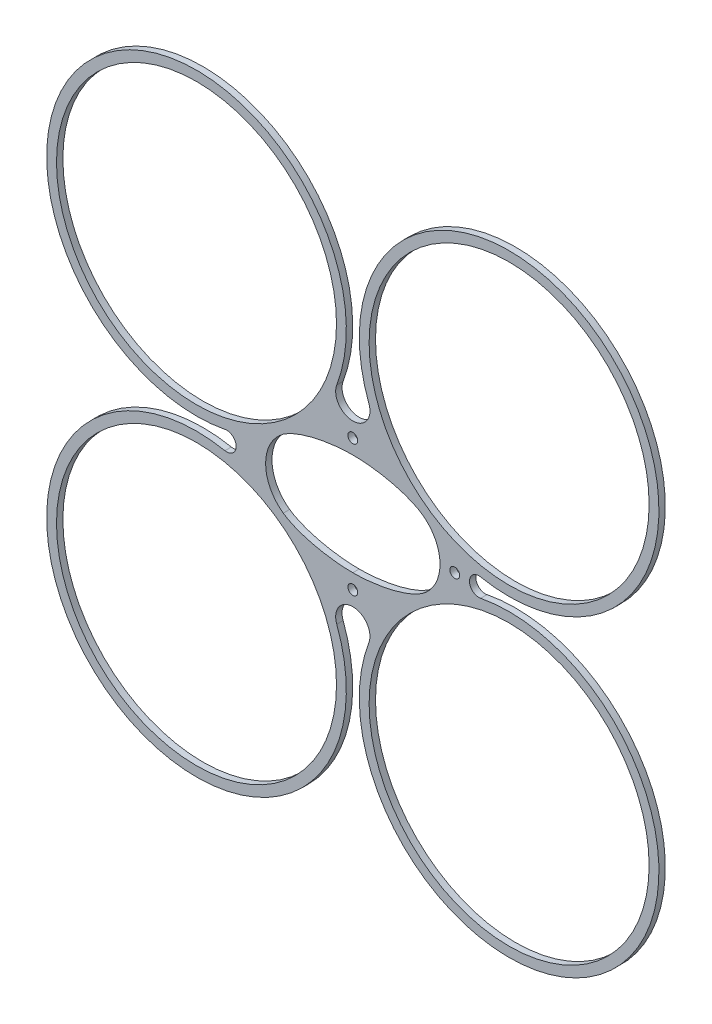
ISO-10303-21;
HEADER;
FILE_DESCRIPTION(('STEP AP214'),'2;1');
FILE_NAME('part.step','',(''),(''),'','','');
FILE_SCHEMA(('AUTOMOTIVE_DESIGN { 1 0 10303 214 1 1 1 1 }'));
ENDSEC;
DATA;
#1=APPLICATION_CONTEXT('core data for automotive mechanical design processes');
#2=APPLICATION_PROTOCOL_DEFINITION('international standard','automotive_design',2000,#1);
#3=PRODUCT_CONTEXT('',#1,'mechanical');
#4=PRODUCT('Part','Part','',(#3));
#5=PRODUCT_RELATED_PRODUCT_CATEGORY('part','',(#4));
#6=PRODUCT_DEFINITION_FORMATION('','',#4);
#7=PRODUCT_DEFINITION_CONTEXT('part definition',#1,'design');
#8=PRODUCT_DEFINITION('design','',#6,#7);
#9=PRODUCT_DEFINITION_SHAPE('','',#8);
#10=(LENGTH_UNIT() NAMED_UNIT(*) SI_UNIT(.MILLI.,.METRE.));
#11=(NAMED_UNIT(*) PLANE_ANGLE_UNIT() SI_UNIT($,.RADIAN.));
#12=(NAMED_UNIT(*) SI_UNIT($,.STERADIAN.) SOLID_ANGLE_UNIT());
#13=UNCERTAINTY_MEASURE_WITH_UNIT(LENGTH_MEASURE(1.E-05),#10,'distance_accuracy_value','');
#14=(GEOMETRIC_REPRESENTATION_CONTEXT(3) GLOBAL_UNCERTAINTY_ASSIGNED_CONTEXT((#13)) GLOBAL_UNIT_ASSIGNED_CONTEXT((#10,
#11,#12)) REPRESENTATION_CONTEXT('',''));
#15=CARTESIAN_POINT('',(0.,0.,0.));
#16=DIRECTION('',(0.,0.,1.));
#17=DIRECTION('',(1.,0.,0.));
#18=AXIS2_PLACEMENT_3D('',#15,#16,#17);
#19=CARTESIAN_POINT('',(-31.8198051533946,31.8198051533946,1.3));
#20=DIRECTION('',(0.,0.,-1.));
#21=DIRECTION('',(-1.,0.,0.));
#22=AXIS2_PLACEMENT_3D('',#19,#20,#21);
#23=CYLINDRICAL_SURFACE('',#22,30.5);
#24=DIRECTION('',(0.,0.,-1.));
#25=VECTOR('',#24,1.);
#26=CARTESIAN_POINT('',(-26.0235218489606,1.87563877904487,32.954508908163));
#27=LINE('',#26,#25);
#28=CARTESIAN_POINT('',(-26.0235218489606,1.87563877904487,1.3));
#29=VERTEX_POINT('',#28);
#30=CARTESIAN_POINT('',(-26.0235218489606,1.87563877904487,0.));
#31=VERTEX_POINT('',#30);
#32=EDGE_CURVE('E217',#29,#31,#27,.T.);
#33=ORIENTED_EDGE('',*,*,#32,.F.);
#34=CARTESIAN_POINT('',(-31.8198051533946,31.8198051533946,1.3));
#35=DIRECTION('',(0.,0.,1.));
#36=DIRECTION('',(1.,0.,0.));
#37=AXIS2_PLACEMENT_3D('',#34,#35,#36);
#38=CIRCLE('',#37,30.5);
#39=CARTESIAN_POINT('',(-3.26805949840784,21.0937704689018,1.3));
#40=VERTEX_POINT('',#39);
#41=EDGE_CURVE('E12',#40,#29,#38,.T.);
#42=ORIENTED_EDGE('',*,*,#41,.F.);
#43=DIRECTION('',(0.,0.,-1.));
#44=VECTOR('',#43,1.);
#45=CARTESIAN_POINT('',(-3.26805949840784,21.0937704689018,32.954508908163));
#46=LINE('',#45,#44);
#47=CARTESIAN_POINT('',(-3.26805949840784,21.0937704689018,0.));
#48=VERTEX_POINT('',#47);
#49=EDGE_CURVE('E219',#40,#48,#46,.T.);
#50=ORIENTED_EDGE('',*,*,#49,.T.);
#51=CARTESIAN_POINT('',(-31.8198051533946,31.8198051533946,0.));
#52=DIRECTION('',(0.,0.,1.));
#53=DIRECTION('',(1.,0.,0.));
#54=AXIS2_PLACEMENT_3D('',#51,#52,#53);
#55=CIRCLE('',#54,30.5);
#56=EDGE_CURVE('E49',#48,#31,#55,.T.);
#57=ORIENTED_EDGE('',*,*,#56,.T.);
#58=EDGE_LOOP('',(#33,#42,#50,#57));
#59=FACE_BOUND('',#58,.T.);
#60=ADVANCED_FACE('F45',(#59),#23,.T.);
#61=CARTESIAN_POINT('',(-31.8198051533946,-31.8198051533946,1.3));
#62=DIRECTION('',(0.,0.,-1.));
#63=DIRECTION('',(-1.,0.,0.));
#64=AXIS2_PLACEMENT_3D('',#61,#62,#63);
#65=CYLINDRICAL_SURFACE('',#64,30.5);
#66=CARTESIAN_POINT('',(-31.8198051533946,-31.8198051533946,1.3));
#67=DIRECTION('',(0.,0.,1.));
#68=DIRECTION('',(1.,0.,0.));
#69=AXIS2_PLACEMENT_3D('',#66,#67,#68);
#70=CIRCLE('',#69,30.5);
#71=CARTESIAN_POINT('',(-3.26805949840784,-21.0937704689018,1.3));
#72=VERTEX_POINT('',#71);
#73=CARTESIAN_POINT('',(-26.0235218489606,-1.87563877904487,1.3));
#74=VERTEX_POINT('',#73);
#75=EDGE_CURVE('E67',#72,#74,#70,.F.);
#76=ORIENTED_EDGE('',*,*,#75,.T.);
#77=DIRECTION('',(0.,0.,-1.));
#78=VECTOR('',#77,1.);
#79=CARTESIAN_POINT('',(-26.0235218489606,-1.87563877904487,32.954508908163));
#80=LINE('',#79,#78);
#81=CARTESIAN_POINT('',(-26.0235218489606,-1.87563877904487,0.));
#82=VERTEX_POINT('',#81);
#83=EDGE_CURVE('E62',#74,#82,#80,.T.);
#84=ORIENTED_EDGE('',*,*,#83,.T.);
#85=CARTESIAN_POINT('',(-31.8198051533946,-31.8198051533946,0.));
#86=DIRECTION('',(0.,0.,1.));
#87=DIRECTION('',(1.,0.,0.));
#88=AXIS2_PLACEMENT_3D('',#85,#86,#87);
#89=CIRCLE('',#88,30.5);
#90=CARTESIAN_POINT('',(-3.26805949840783,-21.0937704689018,0.));
#91=VERTEX_POINT('',#90);
#92=EDGE_CURVE('E168',#91,#82,#89,.F.);
#93=ORIENTED_EDGE('',*,*,#92,.F.);
#94=DIRECTION('',(0.,0.,-1.));
#95=VECTOR('',#94,1.);
#96=CARTESIAN_POINT('',(-3.26805949840783,-21.0937704689018,32.954508908163));
#97=LINE('',#96,#95);
#98=EDGE_CURVE('E262',#72,#91,#97,.T.);
#99=ORIENTED_EDGE('',*,*,#98,.F.);
#100=EDGE_LOOP('',(#76,#84,#93,#99));
#101=FACE_BOUND('',#100,.T.);
#102=ADVANCED_FACE('F352',(#101),#65,.T.);
#103=CARTESIAN_POINT('',(31.8198051533946,31.8198051533946,1.3));
#104=DIRECTION('',(0.,0.,-1.));
#105=DIRECTION('',(-1.,0.,0.));
#106=AXIS2_PLACEMENT_3D('',#103,#104,#105);
#107=CYLINDRICAL_SURFACE('',#106,30.5);
#108=CARTESIAN_POINT('',(31.8198051533946,31.8198051533946,1.3));
#109=DIRECTION('',(0.,0.,1.));
#110=DIRECTION('',(1.,0.,0.));
#111=AXIS2_PLACEMENT_3D('',#108,#109,#110);
#112=CIRCLE('',#111,30.5);
#113=CARTESIAN_POINT('',(3.26805949840783,21.0937704689018,1.3));
#114=VERTEX_POINT('',#113);
#115=CARTESIAN_POINT('',(26.0235218489606,1.87563877904487,1.3));
#116=VERTEX_POINT('',#115);
#117=EDGE_CURVE('E400',#114,#116,#112,.F.);
#118=ORIENTED_EDGE('',*,*,#117,.T.);
#119=DIRECTION('',(0.,0.,-1.));
#120=VECTOR('',#119,1.);
#121=CARTESIAN_POINT('',(26.0235218489606,1.87563877904486,32.954508908163));
#122=LINE('',#121,#120);
#123=CARTESIAN_POINT('',(26.0235218489606,1.87563877904487,0.));
#124=VERTEX_POINT('',#123);
#125=EDGE_CURVE('E408',#116,#124,#122,.T.);
#126=ORIENTED_EDGE('',*,*,#125,.T.);
#127=CARTESIAN_POINT('',(31.8198051533946,31.8198051533946,0.));
#128=DIRECTION('',(0.,0.,1.));
#129=DIRECTION('',(1.,0.,0.));
#130=AXIS2_PLACEMENT_3D('',#127,#128,#129);
#131=CIRCLE('',#130,30.5);
#132=CARTESIAN_POINT('',(3.26805949840783,21.0937704689018,0.));
#133=VERTEX_POINT('',#132);
#134=EDGE_CURVE('E401',#133,#124,#131,.F.);
#135=ORIENTED_EDGE('',*,*,#134,.F.);
#136=DIRECTION('',(0.,0.,-1.));
#137=VECTOR('',#136,1.);
#138=CARTESIAN_POINT('',(3.26805949840783,21.0937704689018,32.954508908163));
#139=LINE('',#138,#137);
#140=EDGE_CURVE('E372',#114,#133,#139,.T.);
#141=ORIENTED_EDGE('',*,*,#140,.F.);
#142=EDGE_LOOP('',(#118,#126,#135,#141));
#143=FACE_BOUND('',#142,.T.);
#144=ADVANCED_FACE('F349',(#143),#107,.T.);
#145=CARTESIAN_POINT('',(-31.8198051533946,31.8198051533946,1.3));
#146=DIRECTION('',(0.,0.,-1.));
#147=DIRECTION('',(-1.,0.,0.));
#148=AXIS2_PLACEMENT_3D('',#145,#146,#147);
#149=CYLINDRICAL_SURFACE('',#148,28.5);
#150=CARTESIAN_POINT('',(-31.8198051533946,31.8198051533946,1.3));
#151=DIRECTION('',(0.,0.,1.));
#152=DIRECTION('',(1.,0.,0.));
#153=AXIS2_PLACEMENT_3D('',#150,#151,#152);
#154=CIRCLE('',#153,28.5);
#155=CARTESIAN_POINT('',(-3.31980515339463,31.8198051533946,1.3));
#156=VERTEX_POINT('',#155);
#157=EDGE_CURVE('E54',#156,#156,#154,.T.);
#158=ORIENTED_EDGE('',*,*,#157,.T.);
#159=EDGE_LOOP('',(#158));
#160=FACE_BOUND('',#159,.T.);
#161=CARTESIAN_POINT('',(-31.8198051533946,31.8198051533946,0.));
#162=DIRECTION('',(0.,0.,1.));
#163=DIRECTION('',(1.,0.,0.));
#164=AXIS2_PLACEMENT_3D('',#161,#162,#163);
#165=CIRCLE('',#164,28.5);
#166=CARTESIAN_POINT('',(-3.31980515339463,31.8198051533946,0.));
#167=VERTEX_POINT('',#166);
#168=EDGE_CURVE('E180',#167,#167,#165,.T.);
#169=ORIENTED_EDGE('',*,*,#168,.F.);
#170=EDGE_LOOP('',(#169));
#171=FACE_BOUND('',#170,.T.);
#172=ADVANCED_FACE('F47',(#160,#171),#149,.F.);
#173=CARTESIAN_POINT('',(0.,0.,1.3));
#174=DIRECTION('',(0.,0.,1.));
#175=DIRECTION('',(1.,0.,0.));
#176=AXIS2_PLACEMENT_3D('',#173,#174,#175);
#177=PLANE('',#176);
#178=ORIENTED_EDGE('',*,*,#41,.T.);
#179=CARTESIAN_POINT('',(-25.6604550130296,0.,1.3));
#180=DIRECTION('',(0.,0.,1.));
#181=DIRECTION('',(1.,0.,0.));
#182=AXIS2_PLACEMENT_3D('',#179,#180,#181);
#183=CIRCLE('',#182,1.91045501302958);
#184=EDGE_CURVE('E169',#29,#74,#183,.F.);
#185=ORIENTED_EDGE('',*,*,#184,.T.);
#186=ORIENTED_EDGE('',*,*,#75,.F.);
#187=CARTESIAN_POINT('',(0.,-19.8660585120048,1.3));
#188=DIRECTION('',(0.,0.,1.));
#189=DIRECTION('',(1.,0.,0.));
#190=AXIS2_PLACEMENT_3D('',#187,#188,#189);
#191=CIRCLE('',#190,3.49105851200484);
#192=CARTESIAN_POINT('',(3.26805949840784,-21.0937704689018,1.3));
#193=VERTEX_POINT('',#192);
#194=EDGE_CURVE('E274',#72,#193,#191,.F.);
#195=ORIENTED_EDGE('',*,*,#194,.T.);
#196=CARTESIAN_POINT('',(31.8198051533946,-31.8198051533946,1.3));
#197=DIRECTION('',(0.,0.,1.));
#198=DIRECTION('',(1.,0.,0.));
#199=AXIS2_PLACEMENT_3D('',#196,#197,#198);
#200=CIRCLE('',#199,30.5);
#201=CARTESIAN_POINT('',(26.0235218489606,-1.87563877904487,1.3));
#202=VERTEX_POINT('',#201);
#203=EDGE_CURVE('E411',#193,#202,#200,.T.);
#204=ORIENTED_EDGE('',*,*,#203,.T.);
#205=CARTESIAN_POINT('',(25.6604550130296,0.,1.3));
#206=DIRECTION('',(0.,0.,1.));
#207=DIRECTION('',(1.,0.,0.));
#208=AXIS2_PLACEMENT_3D('',#205,#206,#207);
#209=CIRCLE('',#208,1.91045501302958);
#210=EDGE_CURVE('E403',#202,#116,#209,.F.);
#211=ORIENTED_EDGE('',*,*,#210,.T.);
#212=ORIENTED_EDGE('',*,*,#117,.F.);
#213=CARTESIAN_POINT('',(0.,19.8660585120048,1.3));
#214=DIRECTION('',(0.,0.,1.));
#215=DIRECTION('',(1.,0.,0.));
#216=AXIS2_PLACEMENT_3D('',#213,#214,#215);
#217=CIRCLE('',#216,3.49105851200484);
#218=EDGE_CURVE('E175',#114,#40,#217,.F.);
#219=ORIENTED_EDGE('',*,*,#218,.T.);
#220=EDGE_LOOP('',(#178,#185,#186,#195,#204,#211,#212,#219));
#221=FACE_BOUND('',#220,.T.);
#222=ORIENTED_EDGE('',*,*,#157,.F.);
#223=EDGE_LOOP('',(#222));
#224=FACE_BOUND('',#223,.T.);
#225=CARTESIAN_POINT('',(-9.22272994414966,0.,1.3));
#226=DIRECTION('',(0.,0.,1.));
#227=DIRECTION('',(1.,0.,0.));
#228=AXIS2_PLACEMENT_3D('',#225,#226,#227);
#229=CIRCLE('',#228,8.52727005585035);
#230=CARTESIAN_POINT('',(-14.1600817626561,-6.95247377741863,1.3));
#231=VERTEX_POINT('',#230);
#232=CARTESIAN_POINT('',(-14.1600817626561,6.95247377741863,1.3));
#233=VERTEX_POINT('',#232);
#234=EDGE_CURVE('E150',#231,#233,#229,.F.);
#235=ORIENTED_EDGE('',*,*,#234,.T.);
#236=CARTESIAN_POINT('',(-14.1600817626561,6.95247377741862,1.3));
#237=CARTESIAN_POINT('',(-14.0064429353834,7.06158155222128,1.3));
#238=CARTESIAN_POINT('',(-11.2813054528987,8.85129628165308,1.3));
#239=CARTESIAN_POINT('',(-5.53301689050233,10.3110837571394,1.3));
#240=CARTESIAN_POINT('',(-0.273902084835145,10.375,1.3));
#241=CARTESIAN_POINT('',(0.,10.375,1.3));
#242=B_SPLINE_CURVE_WITH_KNOTS('',3,(#236,#237,#238,#239,#240,#241),.UNSPECIFIED.,.F.,.F.,(4,1,
1,4),(0.,0.05,0.95,1.),.UNSPECIFIED.);
#243=CARTESIAN_POINT('',(0.,10.375,1.3));
#244=VERTEX_POINT('',#243);
#245=EDGE_CURVE('E164',#233,#244,#242,.T.);
#246=ORIENTED_EDGE('',*,*,#245,.T.);
#247=CARTESIAN_POINT('',(14.1600817626561,6.95247377741862,1.3));
#248=CARTESIAN_POINT('',(14.0064429353834,7.06158155222129,1.3));
#249=CARTESIAN_POINT('',(11.2813054528987,8.85129628165309,1.3));
#250=CARTESIAN_POINT('',(5.53301689050233,10.3110837571394,1.3));
#251=CARTESIAN_POINT('',(0.273902084835145,10.375,1.3));
#252=CARTESIAN_POINT('',(0.,10.375,1.3));
#253=B_SPLINE_CURVE_WITH_KNOTS('',3,(#247,#248,#249,#250,#251,#252),.UNSPECIFIED.,.F.,.F.,(4,1,
1,4),(0.,0.05,0.95,1.),.UNSPECIFIED.);
#254=CARTESIAN_POINT('',(14.1600817626561,6.95247377741862,1.3));
#255=VERTEX_POINT('',#254);
#256=EDGE_CURVE('E191',#255,#244,#253,.T.);
#257=ORIENTED_EDGE('',*,*,#256,.F.);
#258=CARTESIAN_POINT('',(9.22272994414966,0.,1.3));
#259=DIRECTION('',(0.,0.,1.));
#260=DIRECTION('',(1.,0.,0.));
#261=AXIS2_PLACEMENT_3D('',#258,#259,#260);
#262=CIRCLE('',#261,8.52727005585035);
#263=CARTESIAN_POINT('',(14.1600817626561,-6.95247377741863,1.3));
#264=VERTEX_POINT('',#263);
#265=EDGE_CURVE('E410',#264,#255,#262,.T.);
#266=ORIENTED_EDGE('',*,*,#265,.F.);
#267=CARTESIAN_POINT('',(14.1600817626561,-6.95247377741861,1.3));
#268=CARTESIAN_POINT('',(14.0064429353834,-7.06158155222127,1.3));
#269=CARTESIAN_POINT('',(11.2813054528986,-8.85129628165309,1.3));
#270=CARTESIAN_POINT('',(5.53301689050233,-10.3110837571394,1.3));
#271=CARTESIAN_POINT('',(0.273902084835145,-10.375,1.3));
#272=CARTESIAN_POINT('',(0.,-10.375,1.3));
#273=B_SPLINE_CURVE_WITH_KNOTS('',3,(#267,#268,#269,#270,#271,#272),.UNSPECIFIED.,.F.,.F.,(4,1,
1,4),(0.,0.05,0.95,1.),.UNSPECIFIED.);
#274=CARTESIAN_POINT('',(0.,-10.375,1.3));
#275=VERTEX_POINT('',#274);
#276=EDGE_CURVE('E273',#264,#275,#273,.T.);
#277=ORIENTED_EDGE('',*,*,#276,.T.);
#278=CARTESIAN_POINT('',(-14.1600817626561,-6.95247377741862,1.3));
#279=CARTESIAN_POINT('',(-14.0064429353834,-7.06158155222128,1.3));
#280=CARTESIAN_POINT('',(-11.2813054528987,-8.85129628165308,1.3));
#281=CARTESIAN_POINT('',(-5.53301689050233,-10.3110837571394,1.3));
#282=CARTESIAN_POINT('',(-0.273902084835145,-10.375,1.3));
#283=CARTESIAN_POINT('',(0.,-10.375,1.3));
#284=B_SPLINE_CURVE_WITH_KNOTS('',3,(#278,#279,#280,#281,#282,#283),.UNSPECIFIED.,.F.,.F.,(4,1,
1,4),(0.,0.05,0.95,1.),.UNSPECIFIED.);
#285=EDGE_CURVE('E166',#231,#275,#284,.T.);
#286=ORIENTED_EDGE('',*,*,#285,.F.);
#287=EDGE_LOOP('',(#235,#246,#257,#266,#277,#286));
#288=FACE_BOUND('',#287,.T.);
#289=CARTESIAN_POINT('',(0.,13.375,1.3));
#290=DIRECTION('',(0.,0.,1.));
#291=DIRECTION('',(1.,0.,0.));
#292=AXIS2_PLACEMENT_3D('',#289,#290,#291);
#293=CIRCLE('',#292,1.);
#294=CARTESIAN_POINT('',(1.,13.375,1.3));
#295=VERTEX_POINT('',#294);
#296=EDGE_CURVE('E176',#295,#295,#293,.F.);
#297=ORIENTED_EDGE('',*,*,#296,.T.);
#298=EDGE_LOOP('',(#297));
#299=FACE_BOUND('',#298,.T.);
#300=CARTESIAN_POINT('',(31.8198051533946,31.8198051533946,1.3));
#301=DIRECTION('',(0.,0.,1.));
#302=DIRECTION('',(1.,0.,0.));
#303=AXIS2_PLACEMENT_3D('',#300,#301,#302);
#304=CIRCLE('',#303,28.5);
#305=CARTESIAN_POINT('',(60.3198051533946,31.8198051533946,1.3));
#306=VERTEX_POINT('',#305);
#307=EDGE_CURVE('E158',#306,#306,#304,.F.);
#308=ORIENTED_EDGE('',*,*,#307,.T.);
#309=EDGE_LOOP('',(#308));
#310=FACE_BOUND('',#309,.T.);
#311=CARTESIAN_POINT('',(20.75,0.,1.3));
#312=DIRECTION('',(0.,0.,1.));
#313=DIRECTION('',(1.,0.,0.));
#314=AXIS2_PLACEMENT_3D('',#311,#312,#313);
#315=CIRCLE('',#314,1.);
#316=CARTESIAN_POINT('',(21.75,0.,1.3));
#317=VERTEX_POINT('',#316);
#318=EDGE_CURVE('E420',#317,#317,#315,.F.);
#319=ORIENTED_EDGE('',*,*,#318,.T.);
#320=EDGE_LOOP('',(#319));
#321=FACE_BOUND('',#320,.T.);
#322=CARTESIAN_POINT('',(31.8198051533946,-31.8198051533946,1.3));
#323=DIRECTION('',(0.,0.,1.));
#324=DIRECTION('',(1.,0.,0.));
#325=AXIS2_PLACEMENT_3D('',#322,#323,#324);
#326=CIRCLE('',#325,28.5);
#327=CARTESIAN_POINT('',(60.3198051533946,-31.8198051533946,1.3));
#328=VERTEX_POINT('',#327);
#329=EDGE_CURVE('E434',#328,#328,#326,.T.);
#330=ORIENTED_EDGE('',*,*,#329,.F.);
#331=EDGE_LOOP('',(#330));
#332=FACE_BOUND('',#331,.T.);
#333=CARTESIAN_POINT('',(0.,-13.375,1.3));
#334=DIRECTION('',(0.,0.,1.));
#335=DIRECTION('',(1.,0.,0.));
#336=AXIS2_PLACEMENT_3D('',#333,#334,#335);
#337=CIRCLE('',#336,1.);
#338=CARTESIAN_POINT('',(1.,-13.375,1.3));
#339=VERTEX_POINT('',#338);
#340=EDGE_CURVE('E256',#339,#339,#337,.F.);
#341=ORIENTED_EDGE('',*,*,#340,.T.);
#342=EDGE_LOOP('',(#341));
#343=FACE_BOUND('',#342,.T.);
#344=CARTESIAN_POINT('',(-31.8198051533946,-31.8198051533946,1.3));
#345=DIRECTION('',(0.,0.,1.));
#346=DIRECTION('',(1.,0.,0.));
#347=AXIS2_PLACEMENT_3D('',#344,#345,#346);
#348=CIRCLE('',#347,28.5);
#349=CARTESIAN_POINT('',(-3.31980515339463,-31.8198051533946,1.3));
#350=VERTEX_POINT('',#349);
#351=EDGE_CURVE('E239',#350,#350,#348,.F.);
#352=ORIENTED_EDGE('',*,*,#351,.T.);
#353=EDGE_LOOP('',(#352));
#354=FACE_BOUND('',#353,.T.);
#355=ADVANCED_FACE('F162',(#221,#224,#288,#299,#310,#321,#332,#343,#354),#177,.T.);
#356=CARTESIAN_POINT('',(0.,0.,0.));
#357=DIRECTION('',(0.,0.,1.));
#358=DIRECTION('',(1.,0.,0.));
#359=AXIS2_PLACEMENT_3D('',#356,#357,#358);
#360=PLANE('',#359);
#361=CARTESIAN_POINT('',(-25.6604550130296,0.,0.));
#362=DIRECTION('',(0.,0.,-1.));
#363=DIRECTION('',(-1.,0.,0.));
#364=AXIS2_PLACEMENT_3D('',#361,#362,#363);
#365=CIRCLE('',#364,1.91045501302958);
#366=EDGE_CURVE('E228',#31,#82,#365,.T.);
#367=ORIENTED_EDGE('',*,*,#366,.F.);
#368=ORIENTED_EDGE('',*,*,#56,.F.);
#369=CARTESIAN_POINT('',(0.,19.8660585120048,0.));
#370=DIRECTION('',(0.,0.,-1.));
#371=DIRECTION('',(-1.,0.,0.));
#372=AXIS2_PLACEMENT_3D('',#369,#370,#371);
#373=CIRCLE('',#372,3.49105851200484);
#374=EDGE_CURVE('E226',#133,#48,#373,.T.);
#375=ORIENTED_EDGE('',*,*,#374,.F.);
#376=ORIENTED_EDGE('',*,*,#134,.T.);
#377=CARTESIAN_POINT('',(25.6604550130296,0.,0.));
#378=DIRECTION('',(0.,0.,-1.));
#379=DIRECTION('',(-1.,0.,0.));
#380=AXIS2_PLACEMENT_3D('',#377,#378,#379);
#381=CIRCLE('',#380,1.91045501302958);
#382=CARTESIAN_POINT('',(26.0235218489606,-1.87563877904486,0.));
#383=VERTEX_POINT('',#382);
#384=EDGE_CURVE('E415',#383,#124,#381,.T.);
#385=ORIENTED_EDGE('',*,*,#384,.F.);
#386=CARTESIAN_POINT('',(31.8198051533946,-31.8198051533946,0.));
#387=DIRECTION('',(0.,0.,1.));
#388=DIRECTION('',(1.,0.,0.));
#389=AXIS2_PLACEMENT_3D('',#386,#387,#388);
#390=CIRCLE('',#389,30.5);
#391=CARTESIAN_POINT('',(3.26805949840783,-21.0937704689018,0.));
#392=VERTEX_POINT('',#391);
#393=EDGE_CURVE('E432',#392,#383,#390,.T.);
#394=ORIENTED_EDGE('',*,*,#393,.F.);
#395=CARTESIAN_POINT('',(0.,-19.8660585120048,0.));
#396=DIRECTION('',(0.,0.,-1.));
#397=DIRECTION('',(-1.,0.,0.));
#398=AXIS2_PLACEMENT_3D('',#395,#396,#397);
#399=CIRCLE('',#398,3.49105851200484);
#400=EDGE_CURVE('E257',#91,#392,#399,.T.);
#401=ORIENTED_EDGE('',*,*,#400,.F.);
#402=ORIENTED_EDGE('',*,*,#92,.T.);
#403=EDGE_LOOP('',(#367,#368,#375,#376,#385,#394,#401,#402));
#404=FACE_BOUND('',#403,.T.);
#405=ORIENTED_EDGE('',*,*,#168,.T.);
#406=EDGE_LOOP('',(#405));
#407=FACE_BOUND('',#406,.T.);
#408=CARTESIAN_POINT('',(-14.1600817626561,6.95247377741862,0.));
#409=CARTESIAN_POINT('',(-14.0064429353834,7.06158155222128,0.));
#410=CARTESIAN_POINT('',(-11.2813054528987,8.85129628165308,0.));
#411=CARTESIAN_POINT('',(-5.53301689050233,10.3110837571394,0.));
#412=CARTESIAN_POINT('',(-0.273902084835145,10.375,0.));
#413=CARTESIAN_POINT('',(0.,10.375,0.));
#414=B_SPLINE_CURVE_WITH_KNOTS('',3,(#408,#409,#410,#411,#412,#413),.UNSPECIFIED.,.F.,.F.,(4,1,
1,4),(0.,0.05,0.95,1.),.UNSPECIFIED.);
#415=CARTESIAN_POINT('',(-14.1600817626561,6.95247377741863,0.));
#416=VERTEX_POINT('',#415);
#417=CARTESIAN_POINT('',(0.,10.375,0.));
#418=VERTEX_POINT('',#417);
#419=EDGE_CURVE('E157',#416,#418,#414,.T.);
#420=ORIENTED_EDGE('',*,*,#419,.F.);
#421=CARTESIAN_POINT('',(-9.22272994414966,0.,0.));
#422=DIRECTION('',(0.,0.,-1.));
#423=DIRECTION('',(-1.,0.,0.));
#424=AXIS2_PLACEMENT_3D('',#421,#422,#423);
#425=CIRCLE('',#424,8.52727005585035);
#426=CARTESIAN_POINT('',(-14.1600817626561,-6.95247377741863,0.));
#427=VERTEX_POINT('',#426);
#428=EDGE_CURVE('E152',#427,#416,#425,.T.);
#429=ORIENTED_EDGE('',*,*,#428,.F.);
#430=CARTESIAN_POINT('',(-14.1600817626561,-6.95247377741862,0.));
#431=CARTESIAN_POINT('',(-14.0064429353834,-7.06158155222128,0.));
#432=CARTESIAN_POINT('',(-11.2813054528987,-8.85129628165308,0.));
#433=CARTESIAN_POINT('',(-5.53301689050233,-10.3110837571394,0.));
#434=CARTESIAN_POINT('',(-0.273902084835145,-10.375,0.));
#435=CARTESIAN_POINT('',(0.,-10.375,0.));
#436=B_SPLINE_CURVE_WITH_KNOTS('',3,(#430,#431,#432,#433,#434,#435),.UNSPECIFIED.,.F.,.F.,(4,1,
1,4),(0.,0.05,0.95,1.),.UNSPECIFIED.);
#437=CARTESIAN_POINT('',(0.,-10.375,0.));
#438=VERTEX_POINT('',#437);
#439=EDGE_CURVE('E250',#427,#438,#436,.T.);
#440=ORIENTED_EDGE('',*,*,#439,.T.);
#441=CARTESIAN_POINT('',(14.1600817626561,-6.95247377741861,0.));
#442=CARTESIAN_POINT('',(14.0064429353834,-7.06158155222127,0.));
#443=CARTESIAN_POINT('',(11.2813054528986,-8.85129628165309,0.));
#444=CARTESIAN_POINT('',(5.53301689050233,-10.3110837571394,0.));
#445=CARTESIAN_POINT('',(0.273902084835145,-10.375,0.));
#446=CARTESIAN_POINT('',(0.,-10.375,0.));
#447=B_SPLINE_CURVE_WITH_KNOTS('',3,(#441,#442,#443,#444,#445,#446),.UNSPECIFIED.,.F.,.F.,(4,1,
1,4),(0.,0.05,0.95,1.),.UNSPECIFIED.);
#448=CARTESIAN_POINT('',(14.160081762656,-6.95247377741862,0.));
#449=VERTEX_POINT('',#448);
#450=EDGE_CURVE('E243',#449,#438,#447,.T.);
#451=ORIENTED_EDGE('',*,*,#450,.F.);
#452=CARTESIAN_POINT('',(9.22272994414966,0.,0.));
#453=DIRECTION('',(0.,0.,-1.));
#454=DIRECTION('',(-1.,0.,0.));
#455=AXIS2_PLACEMENT_3D('',#452,#453,#454);
#456=CIRCLE('',#455,8.52727005585035);
#457=CARTESIAN_POINT('',(14.1600817626561,6.95247377741863,0.));
#458=VERTEX_POINT('',#457);
#459=EDGE_CURVE('E425',#449,#458,#456,.F.);
#460=ORIENTED_EDGE('',*,*,#459,.T.);
#461=CARTESIAN_POINT('',(14.1600817626561,6.95247377741862,0.));
#462=CARTESIAN_POINT('',(14.0064429353834,7.06158155222129,0.));
#463=CARTESIAN_POINT('',(11.2813054528987,8.85129628165309,0.));
#464=CARTESIAN_POINT('',(5.53301689050233,10.3110837571394,0.));
#465=CARTESIAN_POINT('',(0.273902084835145,10.375,0.));
#466=CARTESIAN_POINT('',(0.,10.375,0.));
#467=B_SPLINE_CURVE_WITH_KNOTS('',3,(#461,#462,#463,#464,#465,#466),.UNSPECIFIED.,.F.,.F.,(4,1,
1,4),(0.,0.05,0.95,1.),.UNSPECIFIED.);
#468=EDGE_CURVE('E184',#458,#418,#467,.T.);
#469=ORIENTED_EDGE('',*,*,#468,.T.);
#470=EDGE_LOOP('',(#420,#429,#440,#451,#460,#469));
#471=FACE_BOUND('',#470,.T.);
#472=CARTESIAN_POINT('',(0.,13.375,0.));
#473=DIRECTION('',(0.,0.,-1.));
#474=DIRECTION('',(-1.,0.,0.));
#475=AXIS2_PLACEMENT_3D('',#472,#473,#474);
#476=CIRCLE('',#475,1.);
#477=CARTESIAN_POINT('',(-1.,13.375,0.));
#478=VERTEX_POINT('',#477);
#479=EDGE_CURVE('E371',#478,#478,#476,.T.);
#480=ORIENTED_EDGE('',*,*,#479,.F.);
#481=EDGE_LOOP('',(#480));
#482=FACE_BOUND('',#481,.T.);
#483=CARTESIAN_POINT('',(31.8198051533946,31.8198051533946,0.));
#484=DIRECTION('',(0.,0.,1.));
#485=DIRECTION('',(1.,0.,0.));
#486=AXIS2_PLACEMENT_3D('',#483,#484,#485);
#487=CIRCLE('',#486,28.5);
#488=CARTESIAN_POINT('',(60.3198051533946,31.8198051533946,0.));
#489=VERTEX_POINT('',#488);
#490=EDGE_CURVE('E397',#489,#489,#487,.F.);
#491=ORIENTED_EDGE('',*,*,#490,.F.);
#492=EDGE_LOOP('',(#491));
#493=FACE_BOUND('',#492,.T.);
#494=CARTESIAN_POINT('',(20.75,0.,0.));
#495=DIRECTION('',(0.,0.,-1.));
#496=DIRECTION('',(-1.,0.,0.));
#497=AXIS2_PLACEMENT_3D('',#494,#495,#496);
#498=CIRCLE('',#497,1.);
#499=CARTESIAN_POINT('',(19.75,0.,0.));
#500=VERTEX_POINT('',#499);
#501=EDGE_CURVE('E428',#500,#500,#498,.T.);
#502=ORIENTED_EDGE('',*,*,#501,.F.);
#503=EDGE_LOOP('',(#502));
#504=FACE_BOUND('',#503,.T.);
#505=CARTESIAN_POINT('',(31.8198051533946,-31.8198051533946,0.));
#506=DIRECTION('',(0.,0.,1.));
#507=DIRECTION('',(1.,0.,0.));
#508=AXIS2_PLACEMENT_3D('',#505,#506,#507);
#509=CIRCLE('',#508,28.5);
#510=CARTESIAN_POINT('',(60.3198051533946,-31.8198051533946,0.));
#511=VERTEX_POINT('',#510);
#512=EDGE_CURVE('E276',#511,#511,#509,.T.);
#513=ORIENTED_EDGE('',*,*,#512,.T.);
#514=EDGE_LOOP('',(#513));
#515=FACE_BOUND('',#514,.T.);
#516=CARTESIAN_POINT('',(0.,-13.375,0.));
#517=DIRECTION('',(0.,0.,-1.));
#518=DIRECTION('',(-1.,0.,0.));
#519=AXIS2_PLACEMENT_3D('',#516,#517,#518);
#520=CIRCLE('',#519,1.);
#521=CARTESIAN_POINT('',(-1.,-13.375,0.));
#522=VERTEX_POINT('',#521);
#523=EDGE_CURVE('E247',#522,#522,#520,.T.);
#524=ORIENTED_EDGE('',*,*,#523,.F.);
#525=EDGE_LOOP('',(#524));
#526=FACE_BOUND('',#525,.T.);
#527=CARTESIAN_POINT('',(-31.8198051533946,-31.8198051533946,0.));
#528=DIRECTION('',(0.,0.,1.));
#529=DIRECTION('',(1.,0.,0.));
#530=AXIS2_PLACEMENT_3D('',#527,#528,#529);
#531=CIRCLE('',#530,28.5);
#532=CARTESIAN_POINT('',(-3.31980515339463,-31.8198051533946,0.));
#533=VERTEX_POINT('',#532);
#534=EDGE_CURVE('E240',#533,#533,#531,.F.);
#535=ORIENTED_EDGE('',*,*,#534,.F.);
#536=EDGE_LOOP('',(#535));
#537=FACE_BOUND('',#536,.T.);
#538=ADVANCED_FACE('F224',(#404,#407,#471,#482,#493,#504,#515,#526,#537),#360,.F.);
#539=CARTESIAN_POINT('',(-14.1600817626561,6.95247377741862,32.954508908163));
#540=CARTESIAN_POINT('',(-14.0064429353834,7.06158155222128,32.954508908163));
#541=CARTESIAN_POINT('',(-11.2813054528987,8.85129628165308,32.954508908163));
#542=CARTESIAN_POINT('',(-5.53301689050233,10.3110837571394,32.954508908163));
#543=CARTESIAN_POINT('',(-0.273902084835145,10.375,32.954508908163));
#544=CARTESIAN_POINT('',(0.,10.375,32.954508908163));
#545=B_SPLINE_CURVE_WITH_KNOTS('',3,(#539,#540,#541,#542,#543,#544),.UNSPECIFIED.,.F.,.F.,(4,1,
1,4),(0.,0.05,0.95,1.),.UNSPECIFIED.);
#546=DIRECTION('',(0.,0.,-1.));
#547=VECTOR('',#546,1.);
#548=SURFACE_OF_LINEAR_EXTRUSION('',#545,#547);
#549=ORIENTED_EDGE('',*,*,#245,.F.);
#550=DIRECTION('',(0.,0.,-1.));
#551=VECTOR('',#550,1.);
#552=CARTESIAN_POINT('',(-14.1600817626561,6.95247377741863,32.954508908163));
#553=LINE('',#552,#551);
#554=EDGE_CURVE('E146',#233,#416,#553,.T.);
#555=ORIENTED_EDGE('',*,*,#554,.T.);
#556=ORIENTED_EDGE('',*,*,#419,.T.);
#557=DIRECTION('',(0.,0.,-1.));
#558=VECTOR('',#557,1.);
#559=CARTESIAN_POINT('',(0.,10.375,32.954508908163));
#560=LINE('',#559,#558);
#561=EDGE_CURVE('E173',#244,#418,#560,.T.);
#562=ORIENTED_EDGE('',*,*,#561,.F.);
#563=EDGE_LOOP('',(#549,#555,#556,#562));
#564=FACE_BOUND('',#563,.T.);
#565=ADVANCED_FACE('F172',(#564),#548,.F.);
#566=CARTESIAN_POINT('',(14.1600817626561,6.95247377741862,32.954508908163));
#567=CARTESIAN_POINT('',(14.0064429353834,7.06158155222129,32.954508908163));
#568=CARTESIAN_POINT('',(11.2813054528987,8.85129628165309,32.954508908163));
#569=CARTESIAN_POINT('',(5.53301689050233,10.3110837571394,32.954508908163));
#570=CARTESIAN_POINT('',(0.273902084835145,10.375,32.954508908163));
#571=CARTESIAN_POINT('',(0.,10.375,32.954508908163));
#572=B_SPLINE_CURVE_WITH_KNOTS('',3,(#566,#567,#568,#569,#570,#571),.UNSPECIFIED.,.F.,.F.,(4,1,
1,4),(0.,0.05,0.95,1.),.UNSPECIFIED.);
#573=DIRECTION('',(0.,0.,-1.));
#574=VECTOR('',#573,1.);
#575=SURFACE_OF_LINEAR_EXTRUSION('',#572,#574);
#576=DIRECTION('',(0.,0.,-1.));
#577=VECTOR('',#576,1.);
#578=CARTESIAN_POINT('',(14.1600817626561,6.95247377741862,32.954508908163));
#579=LINE('',#578,#577);
#580=EDGE_CURVE('E374',#255,#458,#579,.T.);
#581=ORIENTED_EDGE('',*,*,#580,.F.);
#582=ORIENTED_EDGE('',*,*,#256,.T.);
#583=ORIENTED_EDGE('',*,*,#561,.T.);
#584=ORIENTED_EDGE('',*,*,#468,.F.);
#585=EDGE_LOOP('',(#581,#582,#583,#584));
#586=FACE_BOUND('',#585,.T.);
#587=ADVANCED_FACE('F357',(#586),#575,.T.);
#588=CARTESIAN_POINT('',(0.,19.8660585120048,32.954508908163));
#589=DIRECTION('',(0.,0.,-1.));
#590=DIRECTION('',(-1.,0.,0.));
#591=AXIS2_PLACEMENT_3D('',#588,#589,#590);
#592=CYLINDRICAL_SURFACE('',#591,3.49105851200484);
#593=ORIENTED_EDGE('',*,*,#218,.F.);
#594=ORIENTED_EDGE('',*,*,#140,.T.);
#595=ORIENTED_EDGE('',*,*,#374,.T.);
#596=ORIENTED_EDGE('',*,*,#49,.F.);
#597=EDGE_LOOP('',(#593,#594,#595,#596));
#598=FACE_BOUND('',#597,.T.);
#599=ADVANCED_FACE('F354',(#598),#592,.F.);
#600=CARTESIAN_POINT('',(0.,13.375,32.954508908163));
#601=DIRECTION('',(0.,0.,-1.));
#602=DIRECTION('',(-1.,0.,0.));
#603=AXIS2_PLACEMENT_3D('',#600,#601,#602);
#604=CYLINDRICAL_SURFACE('',#603,1.);
#605=ORIENTED_EDGE('',*,*,#479,.T.);
#606=EDGE_LOOP('',(#605));
#607=FACE_BOUND('',#606,.T.);
#608=ORIENTED_EDGE('',*,*,#296,.F.);
#609=EDGE_LOOP('',(#608));
#610=FACE_BOUND('',#609,.T.);
#611=ADVANCED_FACE('F347',(#607,#610),#604,.F.);
#612=CARTESIAN_POINT('',(31.8198051533946,31.8198051533946,1.3));
#613=DIRECTION('',(0.,0.,-1.));
#614=DIRECTION('',(-1.,0.,0.));
#615=AXIS2_PLACEMENT_3D('',#612,#613,#614);
#616=CYLINDRICAL_SURFACE('',#615,28.5);
#617=ORIENTED_EDGE('',*,*,#307,.F.);
#618=EDGE_LOOP('',(#617));
#619=FACE_BOUND('',#618,.T.);
#620=ORIENTED_EDGE('',*,*,#490,.T.);
#621=EDGE_LOOP('',(#620));
#622=FACE_BOUND('',#621,.T.);
#623=ADVANCED_FACE('F340',(#619,#622),#616,.F.);
#624=CARTESIAN_POINT('',(9.22272994414966,0.,32.954508908163));
#625=DIRECTION('',(0.,0.,-1.));
#626=DIRECTION('',(-1.,0.,0.));
#627=AXIS2_PLACEMENT_3D('',#624,#625,#626);
#628=CYLINDRICAL_SURFACE('',#627,8.52727005585035);
#629=DIRECTION('',(0.,0.,-1.));
#630=VECTOR('',#629,1.);
#631=CARTESIAN_POINT('',(14.160081762656,-6.95247377741862,32.954508908163));
#632=LINE('',#631,#630);
#633=EDGE_CURVE('E416',#264,#449,#632,.T.);
#634=ORIENTED_EDGE('',*,*,#633,.F.);
#635=ORIENTED_EDGE('',*,*,#265,.T.);
#636=ORIENTED_EDGE('',*,*,#580,.T.);
#637=ORIENTED_EDGE('',*,*,#459,.F.);
#638=EDGE_LOOP('',(#634,#635,#636,#637));
#639=FACE_BOUND('',#638,.T.);
#640=ADVANCED_FACE('F336',(#639),#628,.F.);
#641=CARTESIAN_POINT('',(25.6604550130296,0.,32.954508908163));
#642=DIRECTION('',(0.,0.,-1.));
#643=DIRECTION('',(-1.,0.,0.));
#644=AXIS2_PLACEMENT_3D('',#641,#642,#643);
#645=CYLINDRICAL_SURFACE('',#644,1.91045501302958);
#646=ORIENTED_EDGE('',*,*,#210,.F.);
#647=DIRECTION('',(0.,0.,-1.));
#648=VECTOR('',#647,1.);
#649=CARTESIAN_POINT('',(26.0235218489606,-1.87563877904486,32.954508908163));
#650=LINE('',#649,#648);
#651=EDGE_CURVE('E412',#202,#383,#650,.T.);
#652=ORIENTED_EDGE('',*,*,#651,.T.);
#653=ORIENTED_EDGE('',*,*,#384,.T.);
#654=ORIENTED_EDGE('',*,*,#125,.F.);
#655=EDGE_LOOP('',(#646,#652,#653,#654));
#656=FACE_BOUND('',#655,.T.);
#657=ADVANCED_FACE('F333',(#656),#645,.F.);
#658=CARTESIAN_POINT('',(20.75,0.,32.954508908163));
#659=DIRECTION('',(0.,0.,-1.));
#660=DIRECTION('',(-1.,0.,0.));
#661=AXIS2_PLACEMENT_3D('',#658,#659,#660);
#662=CYLINDRICAL_SURFACE('',#661,1.);
#663=ORIENTED_EDGE('',*,*,#501,.T.);
#664=EDGE_LOOP('',(#663));
#665=FACE_BOUND('',#664,.T.);
#666=ORIENTED_EDGE('',*,*,#318,.F.);
#667=EDGE_LOOP('',(#666));
#668=FACE_BOUND('',#667,.T.);
#669=ADVANCED_FACE('F328',(#665,#668),#662,.F.);
#670=CARTESIAN_POINT('',(31.8198051533946,-31.8198051533946,1.3));
#671=DIRECTION('',(0.,0.,-1.));
#672=DIRECTION('',(-1.,0.,0.));
#673=AXIS2_PLACEMENT_3D('',#670,#671,#672);
#674=CYLINDRICAL_SURFACE('',#673,30.5);
#675=ORIENTED_EDGE('',*,*,#203,.F.);
#676=DIRECTION('',(0.,0.,-1.));
#677=VECTOR('',#676,1.);
#678=CARTESIAN_POINT('',(3.26805949840783,-21.0937704689018,32.954508908163));
#679=LINE('',#678,#677);
#680=EDGE_CURVE('E251',#193,#392,#679,.T.);
#681=ORIENTED_EDGE('',*,*,#680,.T.);
#682=ORIENTED_EDGE('',*,*,#393,.T.);
#683=ORIENTED_EDGE('',*,*,#651,.F.);
#684=EDGE_LOOP('',(#675,#681,#682,#683));
#685=FACE_BOUND('',#684,.T.);
#686=ADVANCED_FACE('F325',(#685),#674,.T.);
#687=CARTESIAN_POINT('',(31.8198051533946,-31.8198051533946,1.3));
#688=DIRECTION('',(0.,0.,-1.));
#689=DIRECTION('',(-1.,0.,0.));
#690=AXIS2_PLACEMENT_3D('',#687,#688,#689);
#691=CYLINDRICAL_SURFACE('',#690,28.5);
#692=ORIENTED_EDGE('',*,*,#329,.T.);
#693=EDGE_LOOP('',(#692));
#694=FACE_BOUND('',#693,.T.);
#695=ORIENTED_EDGE('',*,*,#512,.F.);
#696=EDGE_LOOP('',(#695));
#697=FACE_BOUND('',#696,.T.);
#698=ADVANCED_FACE('F318',(#694,#697),#691,.F.);
#699=CARTESIAN_POINT('',(14.1600817626561,-6.95247377741861,32.954508908163));
#700=CARTESIAN_POINT('',(14.0064429353834,-7.06158155222127,32.954508908163));
#701=CARTESIAN_POINT('',(11.2813054528986,-8.85129628165309,32.954508908163));
#702=CARTESIAN_POINT('',(5.53301689050233,-10.3110837571394,32.954508908163));
#703=CARTESIAN_POINT('',(0.273902084835145,-10.375,32.954508908163));
#704=CARTESIAN_POINT('',(0.,-10.375,32.954508908163));
#705=B_SPLINE_CURVE_WITH_KNOTS('',3,(#699,#700,#701,#702,#703,#704),.UNSPECIFIED.,.F.,.F.,(4,1,
1,4),(0.,0.05,0.95,1.),.UNSPECIFIED.);
#706=DIRECTION('',(0.,0.,-1.));
#707=VECTOR('',#706,1.);
#708=SURFACE_OF_LINEAR_EXTRUSION('',#705,#707);
#709=ORIENTED_EDGE('',*,*,#276,.F.);
#710=ORIENTED_EDGE('',*,*,#633,.T.);
#711=ORIENTED_EDGE('',*,*,#450,.T.);
#712=DIRECTION('',(0.,0.,-1.));
#713=VECTOR('',#712,1.);
#714=CARTESIAN_POINT('',(0.,-10.375,32.954508908163));
#715=LINE('',#714,#713);
#716=EDGE_CURVE('E280',#275,#438,#715,.T.);
#717=ORIENTED_EDGE('',*,*,#716,.F.);
#718=EDGE_LOOP('',(#709,#710,#711,#717));
#719=FACE_BOUND('',#718,.T.);
#720=ADVANCED_FACE('F313',(#719),#708,.F.);
#721=CARTESIAN_POINT('',(-14.1600817626561,-6.95247377741862,32.954508908163));
#722=CARTESIAN_POINT('',(-14.0064429353834,-7.06158155222128,32.954508908163));
#723=CARTESIAN_POINT('',(-11.2813054528987,-8.85129628165308,32.954508908163));
#724=CARTESIAN_POINT('',(-5.53301689050233,-10.3110837571394,32.954508908163));
#725=CARTESIAN_POINT('',(-0.273902084835145,-10.375,32.954508908163));
#726=CARTESIAN_POINT('',(0.,-10.375,32.954508908163));
#727=B_SPLINE_CURVE_WITH_KNOTS('',3,(#721,#722,#723,#724,#725,#726),.UNSPECIFIED.,.F.,.F.,(4,1,
1,4),(0.,0.05,0.95,1.),.UNSPECIFIED.);
#728=DIRECTION('',(0.,0.,-1.));
#729=VECTOR('',#728,1.);
#730=SURFACE_OF_LINEAR_EXTRUSION('',#727,#729);
#731=DIRECTION('',(0.,0.,-1.));
#732=VECTOR('',#731,1.);
#733=CARTESIAN_POINT('',(-14.1600817626561,-6.95247377741863,32.954508908163));
#734=LINE('',#733,#732);
#735=EDGE_CURVE('E291',#231,#427,#734,.T.);
#736=ORIENTED_EDGE('',*,*,#735,.F.);
#737=ORIENTED_EDGE('',*,*,#285,.T.);
#738=ORIENTED_EDGE('',*,*,#716,.T.);
#739=ORIENTED_EDGE('',*,*,#439,.F.);
#740=EDGE_LOOP('',(#736,#737,#738,#739));
#741=FACE_BOUND('',#740,.T.);
#742=ADVANCED_FACE('F308',(#741),#730,.T.);
#743=CARTESIAN_POINT('',(0.,-19.8660585120048,32.954508908163));
#744=DIRECTION('',(0.,0.,-1.));
#745=DIRECTION('',(-1.,0.,0.));
#746=AXIS2_PLACEMENT_3D('',#743,#744,#745);
#747=CYLINDRICAL_SURFACE('',#746,3.49105851200484);
#748=ORIENTED_EDGE('',*,*,#194,.F.);
#749=ORIENTED_EDGE('',*,*,#98,.T.);
#750=ORIENTED_EDGE('',*,*,#400,.T.);
#751=ORIENTED_EDGE('',*,*,#680,.F.);
#752=EDGE_LOOP('',(#748,#749,#750,#751));
#753=FACE_BOUND('',#752,.T.);
#754=ADVANCED_FACE('F312',(#753),#747,.F.);
#755=CARTESIAN_POINT('',(0.,-13.375,32.954508908163));
#756=DIRECTION('',(0.,0.,-1.));
#757=DIRECTION('',(-1.,0.,0.));
#758=AXIS2_PLACEMENT_3D('',#755,#756,#757);
#759=CYLINDRICAL_SURFACE('',#758,1.);
#760=ORIENTED_EDGE('',*,*,#523,.T.);
#761=EDGE_LOOP('',(#760));
#762=FACE_BOUND('',#761,.T.);
#763=ORIENTED_EDGE('',*,*,#340,.F.);
#764=EDGE_LOOP('',(#763));
#765=FACE_BOUND('',#764,.T.);
#766=ADVANCED_FACE('F320',(#762,#765),#759,.F.);
#767=CARTESIAN_POINT('',(-31.8198051533946,-31.8198051533946,1.3));
#768=DIRECTION('',(0.,0.,-1.));
#769=DIRECTION('',(-1.,0.,0.));
#770=AXIS2_PLACEMENT_3D('',#767,#768,#769);
#771=CYLINDRICAL_SURFACE('',#770,28.5);
#772=ORIENTED_EDGE('',*,*,#351,.F.);
#773=EDGE_LOOP('',(#772));
#774=FACE_BOUND('',#773,.T.);
#775=ORIENTED_EDGE('',*,*,#534,.T.);
#776=EDGE_LOOP('',(#775));
#777=FACE_BOUND('',#776,.T.);
#778=ADVANCED_FACE('F323',(#774,#777),#771,.F.);
#779=CARTESIAN_POINT('',(-25.6604550130296,0.,32.954508908163));
#780=DIRECTION('',(0.,0.,-1.));
#781=DIRECTION('',(-1.,0.,0.));
#782=AXIS2_PLACEMENT_3D('',#779,#780,#781);
#783=CYLINDRICAL_SURFACE('',#782,1.91045501302958);
#784=ORIENTED_EDGE('',*,*,#184,.F.);
#785=ORIENTED_EDGE('',*,*,#32,.T.);
#786=ORIENTED_EDGE('',*,*,#366,.T.);
#787=ORIENTED_EDGE('',*,*,#83,.F.);
#788=EDGE_LOOP('',(#784,#785,#786,#787));
#789=FACE_BOUND('',#788,.T.);
#790=ADVANCED_FACE('F454',(#789),#783,.F.);
#791=CARTESIAN_POINT('',(-9.22272994414966,0.,32.954508908163));
#792=DIRECTION('',(0.,0.,-1.));
#793=DIRECTION('',(-1.,0.,0.));
#794=AXIS2_PLACEMENT_3D('',#791,#792,#793);
#795=CYLINDRICAL_SURFACE('',#794,8.52727005585035);
#796=ORIENTED_EDGE('',*,*,#234,.F.);
#797=ORIENTED_EDGE('',*,*,#735,.T.);
#798=ORIENTED_EDGE('',*,*,#428,.T.);
#799=ORIENTED_EDGE('',*,*,#554,.F.);
#800=EDGE_LOOP('',(#796,#797,#798,#799));
#801=FACE_BOUND('',#800,.T.);
#802=ADVANCED_FACE('F148',(#801),#795,.F.);
#803=CLOSED_SHELL('',(#60,#102,#144,#172,#355,#538,#565,#587,#599,#611,#623,#640,#657,#669,#686,
#698,#720,#742,#754,#766,#778,#790,#802));
#804=MANIFOLD_SOLID_BREP('B2',#803);
#805=ADVANCED_BREP_SHAPE_REPRESENTATION('',(#18,#804),#14);
#806=SHAPE_DEFINITION_REPRESENTATION(#9,#805);
ENDSEC;
END-ISO-10303-21;
